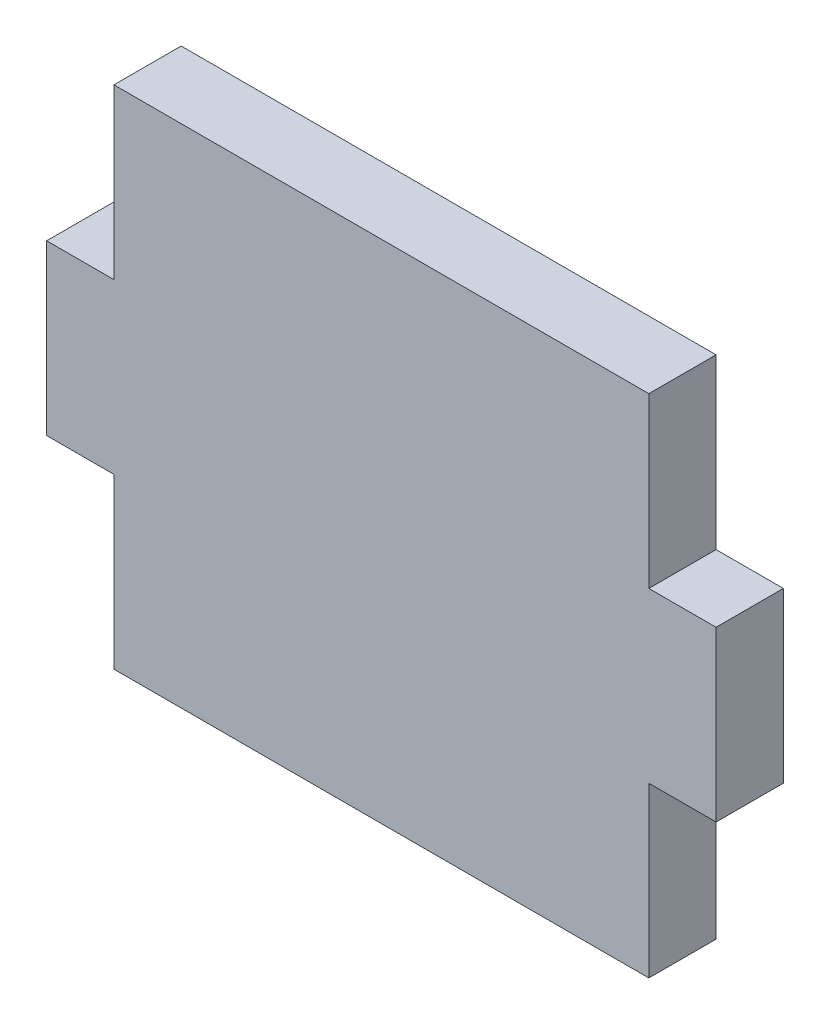
ISO-10303-21;
HEADER;
FILE_DESCRIPTION(('STEP AP214'),'2;1');
FILE_NAME('part.step','',(''),(''),'','','');
FILE_SCHEMA(('AUTOMOTIVE_DESIGN { 1 0 10303 214 1 1 1 1 }'));
ENDSEC;
DATA;
#1=APPLICATION_CONTEXT('core data for automotive mechanical design processes');
#2=APPLICATION_PROTOCOL_DEFINITION('international standard','automotive_design',2000,#1);
#3=PRODUCT_CONTEXT('',#1,'mechanical');
#4=PRODUCT('Part','Part','',(#3));
#5=PRODUCT_RELATED_PRODUCT_CATEGORY('part','',(#4));
#6=PRODUCT_DEFINITION_FORMATION('','',#4);
#7=PRODUCT_DEFINITION_CONTEXT('part definition',#1,'design');
#8=PRODUCT_DEFINITION('design','',#6,#7);
#9=PRODUCT_DEFINITION_SHAPE('','',#8);
#10=(LENGTH_UNIT() NAMED_UNIT(*) SI_UNIT(.MILLI.,.METRE.));
#11=(NAMED_UNIT(*) PLANE_ANGLE_UNIT() SI_UNIT($,.RADIAN.));
#12=(NAMED_UNIT(*) SI_UNIT($,.STERADIAN.) SOLID_ANGLE_UNIT());
#13=UNCERTAINTY_MEASURE_WITH_UNIT(LENGTH_MEASURE(1.E-05),#10,'distance_accuracy_value','');
#14=(GEOMETRIC_REPRESENTATION_CONTEXT(3) GLOBAL_UNCERTAINTY_ASSIGNED_CONTEXT((#13)) GLOBAL_UNIT_ASSIGNED_CONTEXT((#10,
#11,#12)) REPRESENTATION_CONTEXT('',''));
#15=CARTESIAN_POINT('',(0.,0.,0.));
#16=DIRECTION('',(0.,0.,1.));
#17=DIRECTION('',(1.,0.,0.));
#18=AXIS2_PLACEMENT_3D('',#15,#16,#17);
#19=CARTESIAN_POINT('',(0.,0.,5.334));
#20=DIRECTION('',(1.,0.,0.));
#21=DIRECTION('',(0.,1.,0.));
#22=AXIS2_PLACEMENT_3D('',#19,#20,#21);
#23=PLANE('',#22);
#24=DIRECTION('',(0.,0.,1.));
#25=VECTOR('',#24,1.);
#26=CARTESIAN_POINT('',(0.,13.3773333333333,0.));
#27=LINE('',#26,#25);
#28=CARTESIAN_POINT('',(0.,13.3773333333333,0.));
#29=VERTEX_POINT('',#28);
#30=CARTESIAN_POINT('',(0.,13.3773333333333,5.334));
#31=VERTEX_POINT('',#30);
#32=EDGE_CURVE('E210',#29,#31,#27,.T.);
#33=ORIENTED_EDGE('',*,*,#32,.T.);
#34=DIRECTION('',(0.,-1.,0.));
#35=VECTOR('',#34,1.);
#36=CARTESIAN_POINT('',(0.,0.,5.334));
#37=LINE('',#36,#35);
#38=CARTESIAN_POINT('',(0.,26.7546666666667,5.334));
#39=VERTEX_POINT('',#38);
#40=EDGE_CURVE('E162',#39,#31,#37,.T.);
#41=ORIENTED_EDGE('',*,*,#40,.F.);
#42=DIRECTION('',(0.,0.,1.));
#43=VECTOR('',#42,1.);
#44=CARTESIAN_POINT('',(0.,26.7546666666667,0.));
#45=LINE('',#44,#43);
#46=CARTESIAN_POINT('',(0.,26.7546666666667,0.));
#47=VERTEX_POINT('',#46);
#48=EDGE_CURVE('E153',#47,#39,#45,.T.);
#49=ORIENTED_EDGE('',*,*,#48,.F.);
#50=DIRECTION('',(0.,-1.,0.));
#51=VECTOR('',#50,1.);
#52=CARTESIAN_POINT('',(0.,0.,0.));
#53=LINE('',#52,#51);
#54=EDGE_CURVE('E156',#47,#29,#53,.T.);
#55=ORIENTED_EDGE('',*,*,#54,.T.);
#56=EDGE_LOOP('',(#33,#41,#49,#55));
#57=FACE_BOUND('',#56,.T.);
#58=ADVANCED_FACE('F37',(#57),#23,.F.);
#59=CARTESIAN_POINT('',(0.,0.,5.334));
#60=DIRECTION('',(0.,1.,0.));
#61=DIRECTION('',(0.,0.,1.));
#62=AXIS2_PLACEMENT_3D('',#59,#60,#61);
#63=PLANE('',#62);
#64=DIRECTION('',(1.,0.,0.));
#65=VECTOR('',#64,1.);
#66=CARTESIAN_POINT('',(0.,0.,5.334));
#67=LINE('',#66,#65);
#68=CARTESIAN_POINT('',(5.334,0.,5.334));
#69=VERTEX_POINT('',#68);
#70=CARTESIAN_POINT('',(47.752,0.,5.334));
#71=VERTEX_POINT('',#70);
#72=EDGE_CURVE('E165',#69,#71,#67,.T.);
#73=ORIENTED_EDGE('',*,*,#72,.F.);
#74=DIRECTION('',(0.,0.,1.));
#75=VECTOR('',#74,1.);
#76=CARTESIAN_POINT('',(5.334,0.,0.));
#77=LINE('',#76,#75);
#78=CARTESIAN_POINT('',(5.334,0.,0.));
#79=VERTEX_POINT('',#78);
#80=EDGE_CURVE('E214',#79,#69,#77,.T.);
#81=ORIENTED_EDGE('',*,*,#80,.F.);
#82=DIRECTION('',(1.,0.,0.));
#83=VECTOR('',#82,1.);
#84=CARTESIAN_POINT('',(0.,0.,0.));
#85=LINE('',#84,#83);
#86=CARTESIAN_POINT('',(47.752,0.,0.));
#87=VERTEX_POINT('',#86);
#88=EDGE_CURVE('E171',#79,#87,#85,.T.);
#89=ORIENTED_EDGE('',*,*,#88,.T.);
#90=DIRECTION('',(0.,0.,1.));
#91=VECTOR('',#90,1.);
#92=CARTESIAN_POINT('',(47.752,0.,0.));
#93=LINE('',#92,#91);
#94=EDGE_CURVE('E196',#87,#71,#93,.T.);
#95=ORIENTED_EDGE('',*,*,#94,.T.);
#96=EDGE_LOOP('',(#73,#81,#89,#95));
#97=FACE_BOUND('',#96,.T.);
#98=ADVANCED_FACE('F247',(#97),#63,.F.);
#99=CARTESIAN_POINT('',(53.086,0.,5.334));
#100=DIRECTION('',(-1.,0.,0.));
#101=DIRECTION('',(0.,0.,1.));
#102=AXIS2_PLACEMENT_3D('',#99,#100,#101);
#103=PLANE('',#102);
#104=DIRECTION('',(0.,1.,0.));
#105=VECTOR('',#104,1.);
#106=CARTESIAN_POINT('',(53.086,0.,5.334));
#107=LINE('',#106,#105);
#108=CARTESIAN_POINT('',(53.086,13.3773333333333,5.334));
#109=VERTEX_POINT('',#108);
#110=CARTESIAN_POINT('',(53.086,26.7546666666667,5.334));
#111=VERTEX_POINT('',#110);
#112=EDGE_CURVE('E45',#109,#111,#107,.T.);
#113=ORIENTED_EDGE('',*,*,#112,.F.);
#114=DIRECTION('',(0.,0.,1.));
#115=VECTOR('',#114,1.);
#116=CARTESIAN_POINT('',(53.086,13.3773333333333,0.));
#117=LINE('',#116,#115);
#118=CARTESIAN_POINT('',(53.086,13.3773333333333,0.));
#119=VERTEX_POINT('',#118);
#120=EDGE_CURVE('E182',#119,#109,#117,.T.);
#121=ORIENTED_EDGE('',*,*,#120,.F.);
#122=DIRECTION('',(0.,1.,0.));
#123=VECTOR('',#122,1.);
#124=CARTESIAN_POINT('',(53.086,0.,0.));
#125=LINE('',#124,#123);
#126=CARTESIAN_POINT('',(53.086,26.7546666666667,0.));
#127=VERTEX_POINT('',#126);
#128=EDGE_CURVE('E173',#119,#127,#125,.T.);
#129=ORIENTED_EDGE('',*,*,#128,.T.);
#130=DIRECTION('',(0.,0.,1.));
#131=VECTOR('',#130,1.);
#132=CARTESIAN_POINT('',(53.086,26.7546666666667,0.));
#133=LINE('',#132,#131);
#134=EDGE_CURVE('E181',#127,#111,#133,.T.);
#135=ORIENTED_EDGE('',*,*,#134,.T.);
#136=EDGE_LOOP('',(#113,#121,#129,#135));
#137=FACE_BOUND('',#136,.T.);
#138=ADVANCED_FACE('F180',(#137),#103,.F.);
#139=CARTESIAN_POINT('',(0.,40.132,5.334));
#140=DIRECTION('',(0.,-1.,0.));
#141=DIRECTION('',(0.,0.,-1.));
#142=AXIS2_PLACEMENT_3D('',#139,#140,#141);
#143=PLANE('',#142);
#144=DIRECTION('',(-1.,0.,0.));
#145=VECTOR('',#144,1.);
#146=CARTESIAN_POINT('',(0.,40.132,5.334));
#147=LINE('',#146,#145);
#148=CARTESIAN_POINT('',(47.752,40.132,5.334));
#149=VERTEX_POINT('',#148);
#150=CARTESIAN_POINT('',(5.334,40.132,5.334));
#151=VERTEX_POINT('',#150);
#152=EDGE_CURVE('E11',#149,#151,#147,.T.);
#153=ORIENTED_EDGE('',*,*,#152,.F.);
#154=DIRECTION('',(0.,0.,1.));
#155=VECTOR('',#154,1.);
#156=CARTESIAN_POINT('',(47.752,40.132,0.));
#157=LINE('',#156,#155);
#158=CARTESIAN_POINT('',(47.752,40.132,0.));
#159=VERTEX_POINT('',#158);
#160=EDGE_CURVE('E127',#159,#149,#157,.T.);
#161=ORIENTED_EDGE('',*,*,#160,.F.);
#162=DIRECTION('',(-1.,0.,0.));
#163=VECTOR('',#162,1.);
#164=CARTESIAN_POINT('',(0.,40.132,0.));
#165=LINE('',#164,#163);
#166=CARTESIAN_POINT('',(5.334,40.132,0.));
#167=VERTEX_POINT('',#166);
#168=EDGE_CURVE('E40',#159,#167,#165,.T.);
#169=ORIENTED_EDGE('',*,*,#168,.T.);
#170=DIRECTION('',(0.,0.,1.));
#171=VECTOR('',#170,1.);
#172=CARTESIAN_POINT('',(5.334,40.132,0.));
#173=LINE('',#172,#171);
#174=EDGE_CURVE('E150',#167,#151,#173,.T.);
#175=ORIENTED_EDGE('',*,*,#174,.T.);
#176=EDGE_LOOP('',(#153,#161,#169,#175));
#177=FACE_BOUND('',#176,.T.);
#178=ADVANCED_FACE('F149',(#177),#143,.F.);
#179=CARTESIAN_POINT('',(0.,0.,5.334));
#180=DIRECTION('',(0.,0.,-1.));
#181=DIRECTION('',(-1.,0.,0.));
#182=AXIS2_PLACEMENT_3D('',#179,#180,#181);
#183=PLANE('',#182);
#184=DIRECTION('',(1.,0.,0.));
#185=VECTOR('',#184,1.);
#186=CARTESIAN_POINT('',(0.,13.3773333333333,5.334));
#187=LINE('',#186,#185);
#188=CARTESIAN_POINT('',(5.334,13.3773333333333,5.334));
#189=VERTEX_POINT('',#188);
#190=EDGE_CURVE('E199',#31,#189,#187,.T.);
#191=ORIENTED_EDGE('',*,*,#190,.T.);
#192=DIRECTION('',(0.,1.,0.));
#193=VECTOR('',#192,1.);
#194=CARTESIAN_POINT('',(5.334,0.,5.334));
#195=LINE('',#194,#193);
#196=EDGE_CURVE('E217',#69,#189,#195,.T.);
#197=ORIENTED_EDGE('',*,*,#196,.F.);
#198=ORIENTED_EDGE('',*,*,#72,.T.);
#199=DIRECTION('',(0.,1.,0.));
#200=VECTOR('',#199,1.);
#201=CARTESIAN_POINT('',(47.752,0.,5.334));
#202=LINE('',#201,#200);
#203=CARTESIAN_POINT('',(47.752,13.3773333333333,5.334));
#204=VERTEX_POINT('',#203);
#205=EDGE_CURVE('E204',#71,#204,#202,.T.);
#206=ORIENTED_EDGE('',*,*,#205,.T.);
#207=DIRECTION('',(-1.,0.,0.));
#208=VECTOR('',#207,1.);
#209=CARTESIAN_POINT('',(53.086,13.3773333333333,5.334));
#210=LINE('',#209,#208);
#211=EDGE_CURVE('E202',#109,#204,#210,.T.);
#212=ORIENTED_EDGE('',*,*,#211,.F.);
#213=ORIENTED_EDGE('',*,*,#112,.T.);
#214=DIRECTION('',(-1.,0.,0.));
#215=VECTOR('',#214,1.);
#216=CARTESIAN_POINT('',(53.086,26.7546666666667,5.334));
#217=LINE('',#216,#215);
#218=CARTESIAN_POINT('',(47.752,26.7546666666667,5.334));
#219=VERTEX_POINT('',#218);
#220=EDGE_CURVE('E145',#111,#219,#217,.T.);
#221=ORIENTED_EDGE('',*,*,#220,.T.);
#222=DIRECTION('',(0.,-1.,0.));
#223=VECTOR('',#222,1.);
#224=CARTESIAN_POINT('',(47.752,40.132,5.334));
#225=LINE('',#224,#223);
#226=EDGE_CURVE('E130',#149,#219,#225,.T.);
#227=ORIENTED_EDGE('',*,*,#226,.F.);
#228=ORIENTED_EDGE('',*,*,#152,.T.);
#229=DIRECTION('',(0.,-1.,0.));
#230=VECTOR('',#229,1.);
#231=CARTESIAN_POINT('',(5.334,40.132,5.334));
#232=LINE('',#231,#230);
#233=CARTESIAN_POINT('',(5.334,26.7546666666667,5.334));
#234=VERTEX_POINT('',#233);
#235=EDGE_CURVE('E226',#151,#234,#232,.T.);
#236=ORIENTED_EDGE('',*,*,#235,.T.);
#237=DIRECTION('',(1.,0.,0.));
#238=VECTOR('',#237,1.);
#239=CARTESIAN_POINT('',(0.,26.7546666666667,5.334));
#240=LINE('',#239,#238);
#241=EDGE_CURVE('E228',#39,#234,#240,.T.);
#242=ORIENTED_EDGE('',*,*,#241,.F.);
#243=ORIENTED_EDGE('',*,*,#40,.T.);
#244=EDGE_LOOP('',(#191,#197,#198,#206,#212,#213,#221,#227,#228,#236,#242,#243));
#245=FACE_BOUND('',#244,.T.);
#246=ADVANCED_FACE('F142',(#245),#183,.F.);
#247=CARTESIAN_POINT('',(0.,0.,0.));
#248=DIRECTION('',(0.,0.,-1.));
#249=DIRECTION('',(-1.,0.,0.));
#250=AXIS2_PLACEMENT_3D('',#247,#248,#249);
#251=PLANE('',#250);
#252=DIRECTION('',(0.,1.,0.));
#253=VECTOR('',#252,1.);
#254=CARTESIAN_POINT('',(5.334,0.,0.));
#255=LINE('',#254,#253);
#256=CARTESIAN_POINT('',(5.334,13.3773333333333,0.));
#257=VERTEX_POINT('',#256);
#258=EDGE_CURVE('E216',#79,#257,#255,.T.);
#259=ORIENTED_EDGE('',*,*,#258,.T.);
#260=DIRECTION('',(1.,0.,0.));
#261=VECTOR('',#260,1.);
#262=CARTESIAN_POINT('',(0.,13.3773333333333,0.));
#263=LINE('',#262,#261);
#264=EDGE_CURVE('E219',#29,#257,#263,.T.);
#265=ORIENTED_EDGE('',*,*,#264,.F.);
#266=ORIENTED_EDGE('',*,*,#54,.F.);
#267=DIRECTION('',(1.,0.,0.));
#268=VECTOR('',#267,1.);
#269=CARTESIAN_POINT('',(0.,26.7546666666667,0.));
#270=LINE('',#269,#268);
#271=CARTESIAN_POINT('',(5.334,26.7546666666667,0.));
#272=VERTEX_POINT('',#271);
#273=EDGE_CURVE('E223',#47,#272,#270,.T.);
#274=ORIENTED_EDGE('',*,*,#273,.T.);
#275=DIRECTION('',(0.,-1.,0.));
#276=VECTOR('',#275,1.);
#277=CARTESIAN_POINT('',(5.334,40.132,0.));
#278=LINE('',#277,#276);
#279=EDGE_CURVE('E158',#167,#272,#278,.T.);
#280=ORIENTED_EDGE('',*,*,#279,.F.);
#281=ORIENTED_EDGE('',*,*,#168,.F.);
#282=DIRECTION('',(0.,-1.,0.));
#283=VECTOR('',#282,1.);
#284=CARTESIAN_POINT('',(47.752,40.132,0.));
#285=LINE('',#284,#283);
#286=CARTESIAN_POINT('',(47.752,26.7546666666667,0.));
#287=VERTEX_POINT('',#286);
#288=EDGE_CURVE('E133',#159,#287,#285,.T.);
#289=ORIENTED_EDGE('',*,*,#288,.T.);
#290=DIRECTION('',(-1.,0.,0.));
#291=VECTOR('',#290,1.);
#292=CARTESIAN_POINT('',(53.086,26.7546666666667,0.));
#293=LINE('',#292,#291);
#294=EDGE_CURVE('E146',#127,#287,#293,.T.);
#295=ORIENTED_EDGE('',*,*,#294,.F.);
#296=ORIENTED_EDGE('',*,*,#128,.F.);
#297=DIRECTION('',(-1.,0.,0.));
#298=VECTOR('',#297,1.);
#299=CARTESIAN_POINT('',(53.086,13.3773333333333,0.));
#300=LINE('',#299,#298);
#301=CARTESIAN_POINT('',(47.752,13.3773333333333,0.));
#302=VERTEX_POINT('',#301);
#303=EDGE_CURVE('E189',#119,#302,#300,.T.);
#304=ORIENTED_EDGE('',*,*,#303,.T.);
#305=DIRECTION('',(0.,1.,0.));
#306=VECTOR('',#305,1.);
#307=CARTESIAN_POINT('',(47.752,0.,0.));
#308=LINE('',#307,#306);
#309=EDGE_CURVE('E205',#87,#302,#308,.T.);
#310=ORIENTED_EDGE('',*,*,#309,.F.);
#311=ORIENTED_EDGE('',*,*,#88,.F.);
#312=EDGE_LOOP('',(#259,#265,#266,#274,#280,#281,#289,#295,#296,#304,#310,#311));
#313=FACE_BOUND('',#312,.T.);
#314=ADVANCED_FACE('F187',(#313),#251,.T.);
#315=CARTESIAN_POINT('',(0.,26.7546666666667,0.));
#316=DIRECTION('',(0.,-1.,0.));
#317=DIRECTION('',(0.,0.,-1.));
#318=AXIS2_PLACEMENT_3D('',#315,#316,#317);
#319=PLANE('',#318);
#320=ORIENTED_EDGE('',*,*,#241,.T.);
#321=DIRECTION('',(0.,0.,1.));
#322=VECTOR('',#321,1.);
#323=CARTESIAN_POINT('',(5.334,26.7546666666667,0.));
#324=LINE('',#323,#322);
#325=EDGE_CURVE('E154',#272,#234,#324,.T.);
#326=ORIENTED_EDGE('',*,*,#325,.F.);
#327=ORIENTED_EDGE('',*,*,#273,.F.);
#328=ORIENTED_EDGE('',*,*,#48,.T.);
#329=EDGE_LOOP('',(#320,#326,#327,#328));
#330=FACE_BOUND('',#329,.T.);
#331=ADVANCED_FACE('F235',(#330),#319,.F.);
#332=CARTESIAN_POINT('',(5.334,40.132,0.));
#333=DIRECTION('',(-1.,0.,0.));
#334=DIRECTION('',(0.,-1.,0.));
#335=AXIS2_PLACEMENT_3D('',#332,#333,#334);
#336=PLANE('',#335);
#337=ORIENTED_EDGE('',*,*,#235,.F.);
#338=ORIENTED_EDGE('',*,*,#174,.F.);
#339=ORIENTED_EDGE('',*,*,#279,.T.);
#340=ORIENTED_EDGE('',*,*,#325,.T.);
#341=EDGE_LOOP('',(#337,#338,#339,#340));
#342=FACE_BOUND('',#341,.T.);
#343=ADVANCED_FACE('F232',(#342),#336,.T.);
#344=CARTESIAN_POINT('',(53.086,26.7546666666667,0.));
#345=DIRECTION('',(0.,1.,0.));
#346=DIRECTION('',(0.,0.,1.));
#347=AXIS2_PLACEMENT_3D('',#344,#345,#346);
#348=PLANE('',#347);
#349=ORIENTED_EDGE('',*,*,#220,.F.);
#350=ORIENTED_EDGE('',*,*,#134,.F.);
#351=ORIENTED_EDGE('',*,*,#294,.T.);
#352=DIRECTION('',(0.,0.,1.));
#353=VECTOR('',#352,1.);
#354=CARTESIAN_POINT('',(47.752,26.7546666666667,0.));
#355=LINE('',#354,#353);
#356=EDGE_CURVE('E138',#287,#219,#355,.T.);
#357=ORIENTED_EDGE('',*,*,#356,.T.);
#358=EDGE_LOOP('',(#349,#350,#351,#357));
#359=FACE_BOUND('',#358,.T.);
#360=ADVANCED_FACE('F280',(#359),#348,.T.);
#361=CARTESIAN_POINT('',(47.752,40.132,0.));
#362=DIRECTION('',(-1.,0.,0.));
#363=DIRECTION('',(0.,-1.,0.));
#364=AXIS2_PLACEMENT_3D('',#361,#362,#363);
#365=PLANE('',#364);
#366=ORIENTED_EDGE('',*,*,#226,.T.);
#367=ORIENTED_EDGE('',*,*,#356,.F.);
#368=ORIENTED_EDGE('',*,*,#288,.F.);
#369=ORIENTED_EDGE('',*,*,#160,.T.);
#370=EDGE_LOOP('',(#366,#367,#368,#369));
#371=FACE_BOUND('',#370,.T.);
#372=ADVANCED_FACE('F129',(#371),#365,.F.);
#373=CARTESIAN_POINT('',(47.752,0.,0.));
#374=DIRECTION('',(1.,0.,0.));
#375=DIRECTION('',(0.,1.,0.));
#376=AXIS2_PLACEMENT_3D('',#373,#374,#375);
#377=PLANE('',#376);
#378=ORIENTED_EDGE('',*,*,#205,.F.);
#379=ORIENTED_EDGE('',*,*,#94,.F.);
#380=ORIENTED_EDGE('',*,*,#309,.T.);
#381=DIRECTION('',(0.,0.,1.));
#382=VECTOR('',#381,1.);
#383=CARTESIAN_POINT('',(47.752,13.3773333333333,0.));
#384=LINE('',#383,#382);
#385=EDGE_CURVE('E61',#302,#204,#384,.T.);
#386=ORIENTED_EDGE('',*,*,#385,.T.);
#387=EDGE_LOOP('',(#378,#379,#380,#386));
#388=FACE_BOUND('',#387,.T.);
#389=ADVANCED_FACE('F249',(#388),#377,.T.);
#390=CARTESIAN_POINT('',(53.086,13.3773333333333,0.));
#391=DIRECTION('',(0.,1.,0.));
#392=DIRECTION('',(-1.,0.,0.));
#393=AXIS2_PLACEMENT_3D('',#390,#391,#392);
#394=PLANE('',#393);
#395=ORIENTED_EDGE('',*,*,#211,.T.);
#396=ORIENTED_EDGE('',*,*,#385,.F.);
#397=ORIENTED_EDGE('',*,*,#303,.F.);
#398=ORIENTED_EDGE('',*,*,#120,.T.);
#399=EDGE_LOOP('',(#395,#396,#397,#398));
#400=FACE_BOUND('',#399,.T.);
#401=ADVANCED_FACE('F251',(#400),#394,.F.);
#402=CARTESIAN_POINT('',(0.,13.3773333333333,0.));
#403=DIRECTION('',(0.,-1.,0.));
#404=DIRECTION('',(0.,0.,-1.));
#405=AXIS2_PLACEMENT_3D('',#402,#403,#404);
#406=PLANE('',#405);
#407=ORIENTED_EDGE('',*,*,#190,.F.);
#408=ORIENTED_EDGE('',*,*,#32,.F.);
#409=ORIENTED_EDGE('',*,*,#264,.T.);
#410=DIRECTION('',(0.,0.,1.));
#411=VECTOR('',#410,1.);
#412=CARTESIAN_POINT('',(5.334,13.3773333333333,0.));
#413=LINE('',#412,#411);
#414=EDGE_CURVE('E53',#257,#189,#413,.T.);
#415=ORIENTED_EDGE('',*,*,#414,.T.);
#416=EDGE_LOOP('',(#407,#408,#409,#415));
#417=FACE_BOUND('',#416,.T.);
#418=ADVANCED_FACE('F242',(#417),#406,.T.);
#419=CARTESIAN_POINT('',(5.334,0.,0.));
#420=DIRECTION('',(1.,0.,0.));
#421=DIRECTION('',(0.,1.,0.));
#422=AXIS2_PLACEMENT_3D('',#419,#420,#421);
#423=PLANE('',#422);
#424=ORIENTED_EDGE('',*,*,#196,.T.);
#425=ORIENTED_EDGE('',*,*,#414,.F.);
#426=ORIENTED_EDGE('',*,*,#258,.F.);
#427=ORIENTED_EDGE('',*,*,#80,.T.);
#428=EDGE_LOOP('',(#424,#425,#426,#427));
#429=FACE_BOUND('',#428,.T.);
#430=ADVANCED_FACE('F258',(#429),#423,.F.);
#431=CLOSED_SHELL('',(#58,#98,#138,#178,#246,#314,#331,#343,#360,#372,#389,#401,#418,#430));
#432=MANIFOLD_SOLID_BREP('B2',#431);
#433=ADVANCED_BREP_SHAPE_REPRESENTATION('',(#18,#432),#14);
#434=SHAPE_DEFINITION_REPRESENTATION(#9,#433);
ENDSEC;
END-ISO-10303-21;
